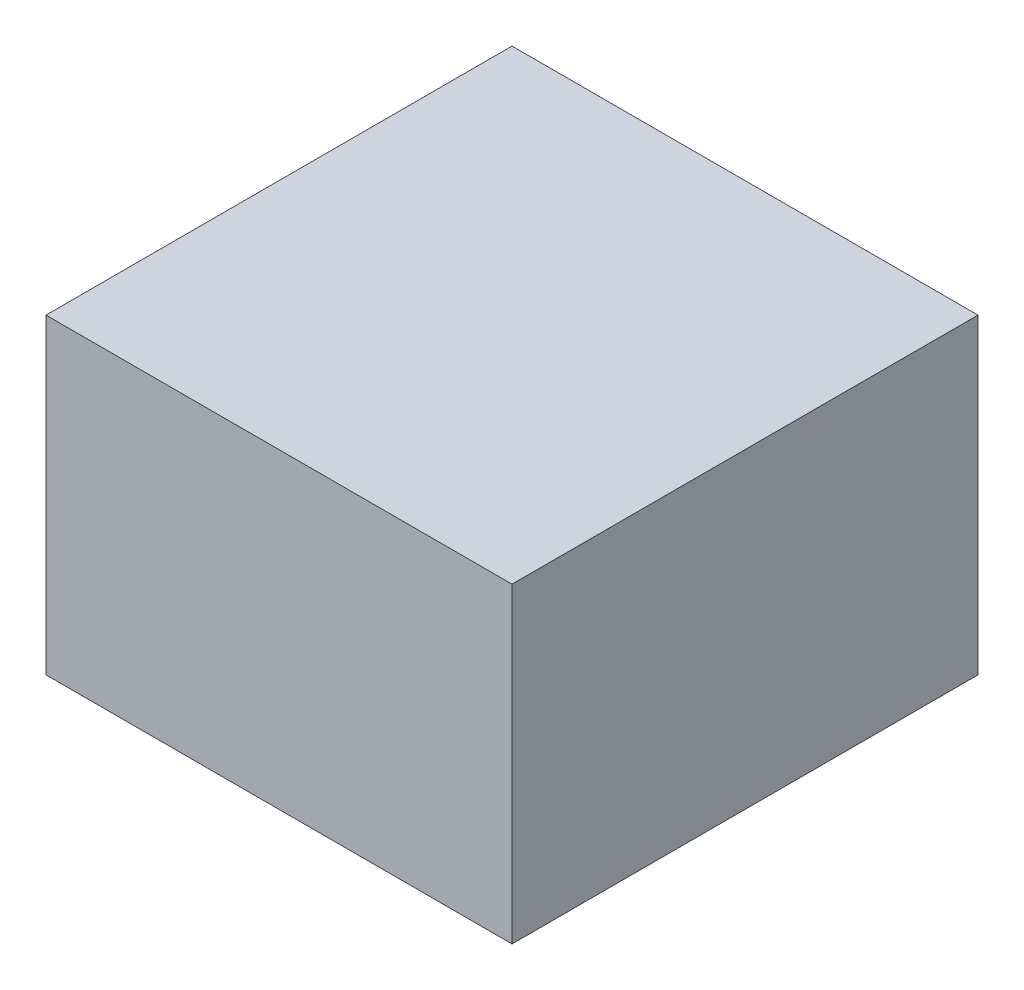
ISO-10303-21;
HEADER;
FILE_DESCRIPTION(('STEP AP214'),'2;1');
FILE_NAME('part.step','',(''),(''),'','','');
FILE_SCHEMA(('AUTOMOTIVE_DESIGN { 1 0 10303 214 1 1 1 1 }'));
ENDSEC;
DATA;
#1=APPLICATION_CONTEXT('core data for automotive mechanical design processes');
#2=APPLICATION_PROTOCOL_DEFINITION('international standard','automotive_design',2000,#1);
#3=PRODUCT_CONTEXT('',#1,'mechanical');
#4=PRODUCT('Part','Part','',(#3));
#5=PRODUCT_RELATED_PRODUCT_CATEGORY('part','',(#4));
#6=PRODUCT_DEFINITION_FORMATION('','',#4);
#7=PRODUCT_DEFINITION_CONTEXT('part definition',#1,'design');
#8=PRODUCT_DEFINITION('design','',#6,#7);
#9=PRODUCT_DEFINITION_SHAPE('','',#8);
#10=(LENGTH_UNIT() NAMED_UNIT(*) SI_UNIT(.MILLI.,.METRE.));
#11=(NAMED_UNIT(*) PLANE_ANGLE_UNIT() SI_UNIT($,.RADIAN.));
#12=(NAMED_UNIT(*) SI_UNIT($,.STERADIAN.) SOLID_ANGLE_UNIT());
#13=UNCERTAINTY_MEASURE_WITH_UNIT(LENGTH_MEASURE(1.E-05),#10,'distance_accuracy_value','');
#14=(GEOMETRIC_REPRESENTATION_CONTEXT(3) GLOBAL_UNCERTAINTY_ASSIGNED_CONTEXT((#13)) GLOBAL_UNIT_ASSIGNED_CONTEXT((#10,
#11,#12)) REPRESENTATION_CONTEXT('',''));
#15=CARTESIAN_POINT('',(0.,0.,0.));
#16=DIRECTION('',(0.,0.,1.));
#17=DIRECTION('',(1.,0.,0.));
#18=AXIS2_PLACEMENT_3D('',#15,#16,#17);
#19=CARTESIAN_POINT('',(-38.5,22.4,-38.5));
#20=DIRECTION('',(1.,0.,0.));
#21=DIRECTION('',(0.,0.,-1.));
#22=AXIS2_PLACEMENT_3D('',#19,#20,#21);
#23=PLANE('',#22);
#24=DIRECTION('',(0.,0.,1.));
#25=VECTOR('',#24,1.);
#26=CARTESIAN_POINT('',(-38.5,-22.4,-38.5));
#27=LINE('',#26,#25);
#28=CARTESIAN_POINT('',(-38.5,-22.4,-38.5));
#29=VERTEX_POINT('',#28);
#30=CARTESIAN_POINT('',(-38.5,-22.4,28.5));
#31=VERTEX_POINT('',#30);
#32=EDGE_CURVE('E106',#29,#31,#27,.T.);
#33=ORIENTED_EDGE('',*,*,#32,.T.);
#34=DIRECTION('',(0.,-1.,0.));
#35=VECTOR('',#34,1.);
#36=CARTESIAN_POINT('',(-38.5,22.4,28.5));
#37=LINE('',#36,#35);
#38=CARTESIAN_POINT('',(-38.5,22.4,28.5));
#39=VERTEX_POINT('',#38);
#40=EDGE_CURVE('E11',#39,#31,#37,.T.);
#41=ORIENTED_EDGE('',*,*,#40,.F.);
#42=DIRECTION('',(0.,0.,1.));
#43=VECTOR('',#42,1.);
#44=CARTESIAN_POINT('',(-38.5,22.4,-38.5));
#45=LINE('',#44,#43);
#46=CARTESIAN_POINT('',(-38.5,22.4,-38.5));
#47=VERTEX_POINT('',#46);
#48=EDGE_CURVE('E94',#47,#39,#45,.T.);
#49=ORIENTED_EDGE('',*,*,#48,.F.);
#50=DIRECTION('',(0.,-1.,0.));
#51=VECTOR('',#50,1.);
#52=CARTESIAN_POINT('',(-38.5,22.4,-38.5));
#53=LINE('',#52,#51);
#54=EDGE_CURVE('E102',#47,#29,#53,.T.);
#55=ORIENTED_EDGE('',*,*,#54,.T.);
#56=EDGE_LOOP('',(#33,#41,#49,#55));
#57=FACE_BOUND('',#56,.T.);
#58=ADVANCED_FACE('F43',(#57),#23,.F.);
#59=CARTESIAN_POINT('',(-38.5,22.4,28.5));
#60=DIRECTION('',(0.,0.,-1.));
#61=DIRECTION('',(-1.,0.,0.));
#62=AXIS2_PLACEMENT_3D('',#59,#60,#61);
#63=PLANE('',#62);
#64=DIRECTION('',(1.,0.,0.));
#65=VECTOR('',#64,1.);
#66=CARTESIAN_POINT('',(-38.5,-22.4,28.5));
#67=LINE('',#66,#65);
#68=CARTESIAN_POINT('',(28.5,-22.4,28.5));
#69=VERTEX_POINT('',#68);
#70=EDGE_CURVE('E98',#31,#69,#67,.T.);
#71=ORIENTED_EDGE('',*,*,#70,.T.);
#72=DIRECTION('',(0.,-1.,0.));
#73=VECTOR('',#72,1.);
#74=CARTESIAN_POINT('',(28.5,22.4,28.5));
#75=LINE('',#74,#73);
#76=CARTESIAN_POINT('',(28.5,22.4,28.5));
#77=VERTEX_POINT('',#76);
#78=EDGE_CURVE('E51',#77,#69,#75,.T.);
#79=ORIENTED_EDGE('',*,*,#78,.F.);
#80=DIRECTION('',(1.,0.,0.));
#81=VECTOR('',#80,1.);
#82=CARTESIAN_POINT('',(-38.5,22.4,28.5));
#83=LINE('',#82,#81);
#84=EDGE_CURVE('E89',#39,#77,#83,.T.);
#85=ORIENTED_EDGE('',*,*,#84,.F.);
#86=ORIENTED_EDGE('',*,*,#40,.T.);
#87=EDGE_LOOP('',(#71,#79,#85,#86));
#88=FACE_BOUND('',#87,.T.);
#89=ADVANCED_FACE('F97',(#88),#63,.F.);
#90=CARTESIAN_POINT('',(28.5,22.4,-38.5));
#91=DIRECTION('',(-1.,0.,0.));
#92=DIRECTION('',(0.,0.,1.));
#93=AXIS2_PLACEMENT_3D('',#90,#91,#92);
#94=PLANE('',#93);
#95=DIRECTION('',(0.,0.,-1.));
#96=VECTOR('',#95,1.);
#97=CARTESIAN_POINT('',(28.5,-22.4,-38.5));
#98=LINE('',#97,#96);
#99=CARTESIAN_POINT('',(28.5,-22.4,-38.5));
#100=VERTEX_POINT('',#99);
#101=EDGE_CURVE('E76',#69,#100,#98,.T.);
#102=ORIENTED_EDGE('',*,*,#101,.T.);
#103=DIRECTION('',(0.,-1.,0.));
#104=VECTOR('',#103,1.);
#105=CARTESIAN_POINT('',(28.5,22.4,-38.5));
#106=LINE('',#105,#104);
#107=CARTESIAN_POINT('',(28.5,22.4,-38.5));
#108=VERTEX_POINT('',#107);
#109=EDGE_CURVE('E99',#108,#100,#106,.T.);
#110=ORIENTED_EDGE('',*,*,#109,.F.);
#111=DIRECTION('',(0.,0.,-1.));
#112=VECTOR('',#111,1.);
#113=CARTESIAN_POINT('',(28.5,22.4,-38.5));
#114=LINE('',#113,#112);
#115=EDGE_CURVE('E92',#77,#108,#114,.T.);
#116=ORIENTED_EDGE('',*,*,#115,.F.);
#117=ORIENTED_EDGE('',*,*,#78,.T.);
#118=EDGE_LOOP('',(#102,#110,#116,#117));
#119=FACE_BOUND('',#118,.T.);
#120=ADVANCED_FACE('F100',(#119),#94,.F.);
#121=CARTESIAN_POINT('',(-38.5,22.4,-38.5));
#122=DIRECTION('',(0.,0.,1.));
#123=DIRECTION('',(1.,0.,0.));
#124=AXIS2_PLACEMENT_3D('',#121,#122,#123);
#125=PLANE('',#124);
#126=DIRECTION('',(-1.,0.,0.));
#127=VECTOR('',#126,1.);
#128=CARTESIAN_POINT('',(-38.5,-22.4,-38.5));
#129=LINE('',#128,#127);
#130=EDGE_CURVE('E82',#100,#29,#129,.T.);
#131=ORIENTED_EDGE('',*,*,#130,.T.);
#132=ORIENTED_EDGE('',*,*,#54,.F.);
#133=DIRECTION('',(-1.,0.,0.));
#134=VECTOR('',#133,1.);
#135=CARTESIAN_POINT('',(-38.5,22.4,-38.5));
#136=LINE('',#135,#134);
#137=EDGE_CURVE('E59',#108,#47,#136,.T.);
#138=ORIENTED_EDGE('',*,*,#137,.F.);
#139=ORIENTED_EDGE('',*,*,#109,.T.);
#140=EDGE_LOOP('',(#131,#132,#138,#139));
#141=FACE_BOUND('',#140,.T.);
#142=ADVANCED_FACE('F113',(#141),#125,.F.);
#143=CARTESIAN_POINT('',(0.,22.4,0.));
#144=DIRECTION('',(0.,1.,0.));
#145=DIRECTION('',(0.,0.,1.));
#146=AXIS2_PLACEMENT_3D('',#143,#144,#145);
#147=PLANE('',#146);
#148=ORIENTED_EDGE('',*,*,#48,.T.);
#149=ORIENTED_EDGE('',*,*,#84,.T.);
#150=ORIENTED_EDGE('',*,*,#115,.T.);
#151=ORIENTED_EDGE('',*,*,#137,.T.);
#152=EDGE_LOOP('',(#148,#149,#150,#151));
#153=FACE_BOUND('',#152,.T.);
#154=ADVANCED_FACE('F90',(#153),#147,.T.);
#155=CARTESIAN_POINT('',(0.,-22.4,0.));
#156=DIRECTION('',(0.,1.,0.));
#157=DIRECTION('',(0.,0.,1.));
#158=AXIS2_PLACEMENT_3D('',#155,#156,#157);
#159=PLANE('',#158);
#160=ORIENTED_EDGE('',*,*,#32,.F.);
#161=ORIENTED_EDGE('',*,*,#130,.F.);
#162=ORIENTED_EDGE('',*,*,#101,.F.);
#163=ORIENTED_EDGE('',*,*,#70,.F.);
#164=EDGE_LOOP('',(#160,#161,#162,#163));
#165=FACE_BOUND('',#164,.T.);
#166=ADVANCED_FACE('F116',(#165),#159,.F.);
#167=CLOSED_SHELL('',(#58,#89,#120,#142,#154,#166));
#168=MANIFOLD_SOLID_BREP('B2',#167);
#169=ADVANCED_BREP_SHAPE_REPRESENTATION('',(#18,#168),#14);
#170=SHAPE_DEFINITION_REPRESENTATION(#9,#169);
ENDSEC;
END-ISO-10303-21;
